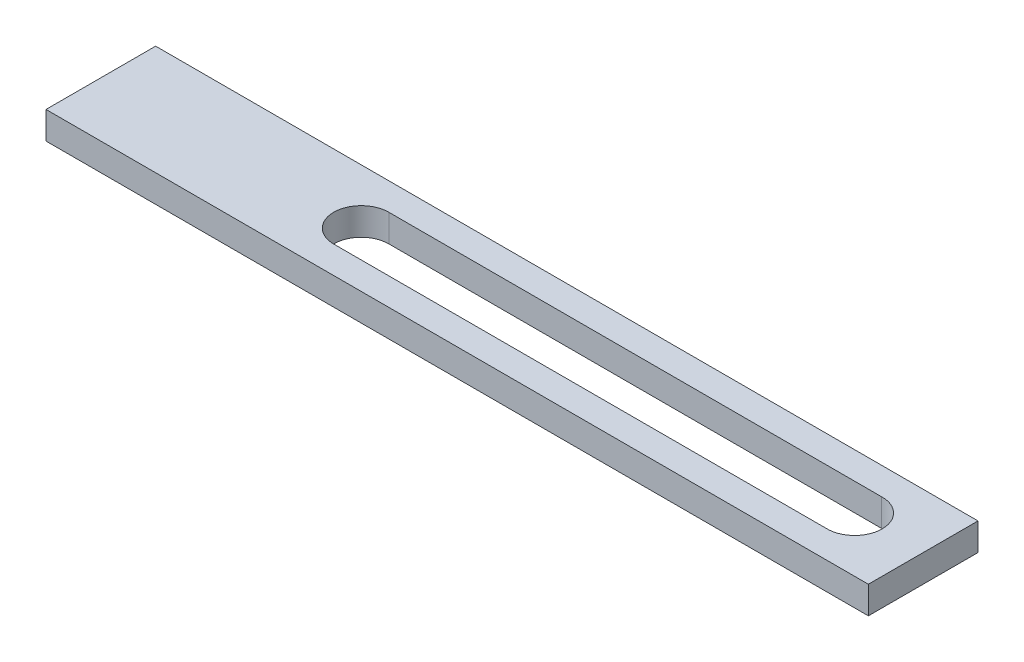
ISO-10303-21;
HEADER;
FILE_DESCRIPTION(('STEP AP214'),'2;1');
FILE_NAME('part.step','',(''),(''),'','','');
FILE_SCHEMA(('AUTOMOTIVE_DESIGN { 1 0 10303 214 1 1 1 1 }'));
ENDSEC;
DATA;
#1=APPLICATION_CONTEXT('core data for automotive mechanical design processes');
#2=APPLICATION_PROTOCOL_DEFINITION('international standard','automotive_design',2000,#1);
#3=PRODUCT_CONTEXT('',#1,'mechanical');
#4=PRODUCT('Part','Part','',(#3));
#5=PRODUCT_RELATED_PRODUCT_CATEGORY('part','',(#4));
#6=PRODUCT_DEFINITION_FORMATION('','',#4);
#7=PRODUCT_DEFINITION_CONTEXT('part definition',#1,'design');
#8=PRODUCT_DEFINITION('design','',#6,#7);
#9=PRODUCT_DEFINITION_SHAPE('','',#8);
#10=(LENGTH_UNIT() NAMED_UNIT(*) SI_UNIT(.MILLI.,.METRE.));
#11=(NAMED_UNIT(*) PLANE_ANGLE_UNIT() SI_UNIT($,.RADIAN.));
#12=(NAMED_UNIT(*) SI_UNIT($,.STERADIAN.) SOLID_ANGLE_UNIT());
#13=UNCERTAINTY_MEASURE_WITH_UNIT(LENGTH_MEASURE(1.E-05),#10,'distance_accuracy_value','');
#14=(GEOMETRIC_REPRESENTATION_CONTEXT(3) GLOBAL_UNCERTAINTY_ASSIGNED_CONTEXT((#13)) GLOBAL_UNIT_ASSIGNED_CONTEXT((#10,
#11,#12)) REPRESENTATION_CONTEXT('',''));
#15=CARTESIAN_POINT('',(0.,0.,0.));
#16=DIRECTION('',(0.,0.,1.));
#17=DIRECTION('',(1.,0.,0.));
#18=AXIS2_PLACEMENT_3D('',#15,#16,#17);
#19=CARTESIAN_POINT('',(0.,10.,0.));
#20=DIRECTION('',(1.,0.,0.));
#21=DIRECTION('',(0.,0.,-1.));
#22=AXIS2_PLACEMENT_3D('',#19,#20,#21);
#23=PLANE('',#22);
#24=DIRECTION('',(0.,0.,1.));
#25=VECTOR('',#24,1.);
#26=CARTESIAN_POINT('',(0.,0.,0.));
#27=LINE('',#26,#25);
#28=CARTESIAN_POINT('',(0.,0.,-40.));
#29=VERTEX_POINT('',#28);
#30=CARTESIAN_POINT('',(0.,0.,0.));
#31=VERTEX_POINT('',#30);
#32=EDGE_CURVE('E104',#29,#31,#27,.T.);
#33=ORIENTED_EDGE('',*,*,#32,.T.);
#34=DIRECTION('',(0.,-1.,0.));
#35=VECTOR('',#34,1.);
#36=CARTESIAN_POINT('',(0.,10.,0.));
#37=LINE('',#36,#35);
#38=CARTESIAN_POINT('',(0.,10.,0.));
#39=VERTEX_POINT('',#38);
#40=EDGE_CURVE('E11',#39,#31,#37,.T.);
#41=ORIENTED_EDGE('',*,*,#40,.F.);
#42=DIRECTION('',(0.,0.,1.));
#43=VECTOR('',#42,1.);
#44=CARTESIAN_POINT('',(0.,10.,0.));
#45=LINE('',#44,#43);
#46=CARTESIAN_POINT('',(0.,10.,-40.));
#47=VERTEX_POINT('',#46);
#48=EDGE_CURVE('E133',#47,#39,#45,.T.);
#49=ORIENTED_EDGE('',*,*,#48,.F.);
#50=DIRECTION('',(0.,-1.,0.));
#51=VECTOR('',#50,1.);
#52=CARTESIAN_POINT('',(0.,10.,-40.));
#53=LINE('',#52,#51);
#54=EDGE_CURVE('E143',#47,#29,#53,.T.);
#55=ORIENTED_EDGE('',*,*,#54,.T.);
#56=EDGE_LOOP('',(#33,#41,#49,#55));
#57=FACE_BOUND('',#56,.T.);
#58=ADVANCED_FACE('F34',(#57),#23,.F.);
#59=CARTESIAN_POINT('',(0.,10.,0.));
#60=DIRECTION('',(0.,0.,-1.));
#61=DIRECTION('',(-1.,0.,0.));
#62=AXIS2_PLACEMENT_3D('',#59,#60,#61);
#63=PLANE('',#62);
#64=DIRECTION('',(1.,0.,0.));
#65=VECTOR('',#64,1.);
#66=CARTESIAN_POINT('',(0.,0.,0.));
#67=LINE('',#66,#65);
#68=CARTESIAN_POINT('',(300.,0.,0.));
#69=VERTEX_POINT('',#68);
#70=EDGE_CURVE('E146',#31,#69,#67,.T.);
#71=ORIENTED_EDGE('',*,*,#70,.T.);
#72=DIRECTION('',(0.,-1.,0.));
#73=VECTOR('',#72,1.);
#74=CARTESIAN_POINT('',(300.,10.,0.));
#75=LINE('',#74,#73);
#76=CARTESIAN_POINT('',(300.,10.,0.));
#77=VERTEX_POINT('',#76);
#78=EDGE_CURVE('E41',#77,#69,#75,.T.);
#79=ORIENTED_EDGE('',*,*,#78,.F.);
#80=DIRECTION('',(1.,0.,0.));
#81=VECTOR('',#80,1.);
#82=CARTESIAN_POINT('',(0.,10.,0.));
#83=LINE('',#82,#81);
#84=EDGE_CURVE('E136',#39,#77,#83,.T.);
#85=ORIENTED_EDGE('',*,*,#84,.F.);
#86=ORIENTED_EDGE('',*,*,#40,.T.);
#87=EDGE_LOOP('',(#71,#79,#85,#86));
#88=FACE_BOUND('',#87,.T.);
#89=ADVANCED_FACE('F174',(#88),#63,.F.);
#90=CARTESIAN_POINT('',(300.,10.,0.));
#91=DIRECTION('',(-1.,0.,0.));
#92=DIRECTION('',(0.,0.,1.));
#93=AXIS2_PLACEMENT_3D('',#90,#91,#92);
#94=PLANE('',#93);
#95=DIRECTION('',(0.,0.,-1.));
#96=VECTOR('',#95,1.);
#97=CARTESIAN_POINT('',(300.,0.,0.));
#98=LINE('',#97,#96);
#99=CARTESIAN_POINT('',(300.,0.,-40.));
#100=VERTEX_POINT('',#99);
#101=EDGE_CURVE('E148',#69,#100,#98,.T.);
#102=ORIENTED_EDGE('',*,*,#101,.T.);
#103=DIRECTION('',(0.,-1.,0.));
#104=VECTOR('',#103,1.);
#105=CARTESIAN_POINT('',(300.,10.,-40.));
#106=LINE('',#105,#104);
#107=CARTESIAN_POINT('',(300.,10.,-40.));
#108=VERTEX_POINT('',#107);
#109=EDGE_CURVE('E153',#108,#100,#106,.T.);
#110=ORIENTED_EDGE('',*,*,#109,.F.);
#111=DIRECTION('',(0.,0.,-1.));
#112=VECTOR('',#111,1.);
#113=CARTESIAN_POINT('',(300.,10.,0.));
#114=LINE('',#113,#112);
#115=EDGE_CURVE('E139',#77,#108,#114,.T.);
#116=ORIENTED_EDGE('',*,*,#115,.F.);
#117=ORIENTED_EDGE('',*,*,#78,.T.);
#118=EDGE_LOOP('',(#102,#110,#116,#117));
#119=FACE_BOUND('',#118,.T.);
#120=ADVANCED_FACE('F160',(#119),#94,.F.);
#121=CARTESIAN_POINT('',(0.,10.,-40.));
#122=DIRECTION('',(0.,0.,1.));
#123=DIRECTION('',(1.,0.,0.));
#124=AXIS2_PLACEMENT_3D('',#121,#122,#123);
#125=PLANE('',#124);
#126=DIRECTION('',(-1.,0.,0.));
#127=VECTOR('',#126,1.);
#128=CARTESIAN_POINT('',(0.,0.,-40.));
#129=LINE('',#128,#127);
#130=EDGE_CURVE('E137',#100,#29,#129,.T.);
#131=ORIENTED_EDGE('',*,*,#130,.T.);
#132=ORIENTED_EDGE('',*,*,#54,.F.);
#133=DIRECTION('',(-1.,0.,0.));
#134=VECTOR('',#133,1.);
#135=CARTESIAN_POINT('',(0.,10.,-40.));
#136=LINE('',#135,#134);
#137=EDGE_CURVE('E141',#108,#47,#136,.T.);
#138=ORIENTED_EDGE('',*,*,#137,.F.);
#139=ORIENTED_EDGE('',*,*,#109,.T.);
#140=EDGE_LOOP('',(#131,#132,#138,#139));
#141=FACE_BOUND('',#140,.T.);
#142=ADVANCED_FACE('F167',(#141),#125,.F.);
#143=CARTESIAN_POINT('',(0.,10.,0.));
#144=DIRECTION('',(0.,-1.,0.));
#145=DIRECTION('',(0.,0.,-1.));
#146=AXIS2_PLACEMENT_3D('',#143,#144,#145);
#147=PLANE('',#146);
#148=DIRECTION('',(0.999999999769228,0.,-2.14835530012915E-05));
#149=VECTOR('',#148,1.);
#150=CARTESIAN_POINT('',(95.,10.,-9.95));
#151=LINE('',#150,#149);
#152=CARTESIAN_POINT('',(95.,10.,-9.95));
#153=VERTEX_POINT('',#152);
#154=CARTESIAN_POINT('',(274.721446051857,10.,-9.95386105521261));
#155=VERTEX_POINT('',#154);
#156=EDGE_CURVE('E117',#153,#155,#151,.T.);
#157=ORIENTED_EDGE('',*,*,#156,.F.);
#158=CARTESIAN_POINT('',(95.,10.,-20.));
#159=DIRECTION('',(0.,1.,0.));
#160=DIRECTION('',(0.,0.,1.));
#161=AXIS2_PLACEMENT_3D('',#158,#159,#160);
#162=CIRCLE('',#161,10.05);
#163=CARTESIAN_POINT('',(95.,10.,-30.05));
#164=VERTEX_POINT('',#163);
#165=EDGE_CURVE('E48',#164,#153,#162,.T.);
#166=ORIENTED_EDGE('',*,*,#165,.F.);
#167=DIRECTION('',(-0.999999999769228,0.,-2.14835530012818E-05));
#168=VECTOR('',#167,1.);
#169=CARTESIAN_POINT('',(95.,10.,-30.05));
#170=LINE('',#169,#168);
#171=CARTESIAN_POINT('',(274.721446051857,10.,-30.0461389447874));
#172=VERTEX_POINT('',#171);
#173=EDGE_CURVE('E110',#172,#164,#170,.T.);
#174=ORIENTED_EDGE('',*,*,#173,.F.);
#175=CARTESIAN_POINT('',(275.,10.,-20.));
#176=DIRECTION('',(0.,1.,0.));
#177=DIRECTION('',(0.,0.,-1.));
#178=AXIS2_PLACEMENT_3D('',#175,#176,#177);
#179=CIRCLE('',#178,10.05);
#180=EDGE_CURVE('E124',#155,#172,#179,.T.);
#181=ORIENTED_EDGE('',*,*,#180,.F.);
#182=EDGE_LOOP('',(#157,#166,#174,#181));
#183=FACE_BOUND('',#182,.T.);
#184=ORIENTED_EDGE('',*,*,#48,.T.);
#185=ORIENTED_EDGE('',*,*,#84,.T.);
#186=ORIENTED_EDGE('',*,*,#115,.T.);
#187=ORIENTED_EDGE('',*,*,#137,.T.);
#188=EDGE_LOOP('',(#184,#185,#186,#187));
#189=FACE_BOUND('',#188,.T.);
#190=ADVANCED_FACE('F173',(#183,#189),#147,.F.);
#191=CARTESIAN_POINT('',(0.,0.,0.));
#192=DIRECTION('',(0.,-1.,0.));
#193=DIRECTION('',(0.,0.,-1.));
#194=AXIS2_PLACEMENT_3D('',#191,#192,#193);
#195=PLANE('',#194);
#196=CARTESIAN_POINT('',(95.,0.,-20.));
#197=DIRECTION('',(0.,-1.,0.));
#198=DIRECTION('',(0.,0.,-1.));
#199=AXIS2_PLACEMENT_3D('',#196,#197,#198);
#200=CIRCLE('',#199,10.05);
#201=CARTESIAN_POINT('',(95.,0.,-30.05));
#202=VERTEX_POINT('',#201);
#203=CARTESIAN_POINT('',(95.,0.,-9.95));
#204=VERTEX_POINT('',#203);
#205=EDGE_CURVE('E108',#202,#204,#200,.F.);
#206=ORIENTED_EDGE('',*,*,#205,.T.);
#207=DIRECTION('',(0.999999999769229,0.,-2.14835530012915E-05));
#208=VECTOR('',#207,1.);
#209=CARTESIAN_POINT('',(95.,0.,-9.95));
#210=LINE('',#209,#208);
#211=CARTESIAN_POINT('',(274.721446051857,0.,-9.95386105521261));
#212=VERTEX_POINT('',#211);
#213=EDGE_CURVE('E97',#204,#212,#210,.T.);
#214=ORIENTED_EDGE('',*,*,#213,.T.);
#215=CARTESIAN_POINT('',(275.,0.,-20.));
#216=DIRECTION('',(0.,-1.,0.));
#217=DIRECTION('',(0.,0.,-1.));
#218=AXIS2_PLACEMENT_3D('',#215,#216,#217);
#219=CIRCLE('',#218,10.05);
#220=CARTESIAN_POINT('',(274.721446051857,0.,-30.0461389447874));
#221=VERTEX_POINT('',#220);
#222=EDGE_CURVE('E119',#212,#221,#219,.F.);
#223=ORIENTED_EDGE('',*,*,#222,.T.);
#224=DIRECTION('',(-0.999999999769229,0.,-2.14835530012818E-05));
#225=VECTOR('',#224,1.);
#226=CARTESIAN_POINT('',(95.,0.,-30.05));
#227=LINE('',#226,#225);
#228=EDGE_CURVE('E115',#221,#202,#227,.T.);
#229=ORIENTED_EDGE('',*,*,#228,.T.);
#230=EDGE_LOOP('',(#206,#214,#223,#229));
#231=FACE_BOUND('',#230,.T.);
#232=ORIENTED_EDGE('',*,*,#32,.F.);
#233=ORIENTED_EDGE('',*,*,#130,.F.);
#234=ORIENTED_EDGE('',*,*,#101,.F.);
#235=ORIENTED_EDGE('',*,*,#70,.F.);
#236=EDGE_LOOP('',(#232,#233,#234,#235));
#237=FACE_BOUND('',#236,.T.);
#238=ADVANCED_FACE('F113',(#231,#237),#195,.T.);
#239=CARTESIAN_POINT('',(95.,-0.000999999999999265,-20.));
#240=DIRECTION('',(0.,1.,0.));
#241=DIRECTION('',(0.,0.,1.));
#242=AXIS2_PLACEMENT_3D('',#239,#240,#241);
#243=CYLINDRICAL_SURFACE('',#242,10.05);
#244=DIRECTION('',(0.,1.,0.));
#245=VECTOR('',#244,1.);
#246=CARTESIAN_POINT('',(95.,-0.000999999999999265,-30.05));
#247=LINE('',#246,#245);
#248=EDGE_CURVE('E105',#202,#164,#247,.T.);
#249=ORIENTED_EDGE('',*,*,#248,.T.);
#250=ORIENTED_EDGE('',*,*,#165,.T.);
#251=DIRECTION('',(0.,1.,0.));
#252=VECTOR('',#251,1.);
#253=CARTESIAN_POINT('',(95.,-0.000999999999999265,-9.95));
#254=LINE('',#253,#252);
#255=EDGE_CURVE('E99',#204,#153,#254,.T.);
#256=ORIENTED_EDGE('',*,*,#255,.F.);
#257=ORIENTED_EDGE('',*,*,#205,.F.);
#258=EDGE_LOOP('',(#249,#250,#256,#257));
#259=FACE_BOUND('',#258,.T.);
#260=ADVANCED_FACE('F107',(#259),#243,.F.);
#261=CARTESIAN_POINT('',(95.,-0.000999999999999265,-30.05));
#262=DIRECTION('',(2.14835530012818E-05,0.,-0.999999999769229));
#263=DIRECTION('',(-0.999999999769229,0.,-2.14835530012818E-05));
#264=AXIS2_PLACEMENT_3D('',#261,#262,#263);
#265=PLANE('',#264);
#266=DIRECTION('',(0.,1.,0.));
#267=VECTOR('',#266,1.);
#268=CARTESIAN_POINT('',(274.721446051857,-0.000999999999999265,-30.0461389447874));
#269=LINE('',#268,#267);
#270=EDGE_CURVE('E130',#221,#172,#269,.T.);
#271=ORIENTED_EDGE('',*,*,#270,.T.);
#272=ORIENTED_EDGE('',*,*,#173,.T.);
#273=ORIENTED_EDGE('',*,*,#248,.F.);
#274=ORIENTED_EDGE('',*,*,#228,.F.);
#275=EDGE_LOOP('',(#271,#272,#273,#274));
#276=FACE_BOUND('',#275,.T.);
#277=ADVANCED_FACE('F191',(#276),#265,.F.);
#278=CARTESIAN_POINT('',(275.,-0.000999999999999265,-20.));
#279=DIRECTION('',(0.,1.,0.));
#280=DIRECTION('',(0.,0.,1.));
#281=AXIS2_PLACEMENT_3D('',#278,#279,#280);
#282=CYLINDRICAL_SURFACE('',#281,10.05);
#283=DIRECTION('',(0.,1.,0.));
#284=VECTOR('',#283,1.);
#285=CARTESIAN_POINT('',(274.721446051857,-0.000999999999999265,-9.95386105521261));
#286=LINE('',#285,#284);
#287=EDGE_CURVE('E56',#212,#155,#286,.T.);
#288=ORIENTED_EDGE('',*,*,#287,.T.);
#289=ORIENTED_EDGE('',*,*,#180,.T.);
#290=ORIENTED_EDGE('',*,*,#270,.F.);
#291=ORIENTED_EDGE('',*,*,#222,.F.);
#292=EDGE_LOOP('',(#288,#289,#290,#291));
#293=FACE_BOUND('',#292,.T.);
#294=ADVANCED_FACE('F194',(#293),#282,.F.);
#295=CARTESIAN_POINT('',(95.,-0.000999999999999265,-9.95));
#296=DIRECTION('',(2.14835530012915E-05,0.,0.999999999769229));
#297=DIRECTION('',(0.999999999769229,0.,-2.14835530012915E-05));
#298=AXIS2_PLACEMENT_3D('',#295,#296,#297);
#299=PLANE('',#298);
#300=ORIENTED_EDGE('',*,*,#255,.T.);
#301=ORIENTED_EDGE('',*,*,#156,.T.);
#302=ORIENTED_EDGE('',*,*,#287,.F.);
#303=ORIENTED_EDGE('',*,*,#213,.F.);
#304=EDGE_LOOP('',(#300,#301,#302,#303));
#305=FACE_BOUND('',#304,.T.);
#306=ADVANCED_FACE('F98',(#305),#299,.F.);
#307=CLOSED_SHELL('',(#58,#89,#120,#142,#190,#238,#260,#277,#294,#306));
#308=MANIFOLD_SOLID_BREP('B2',#307);
#309=ADVANCED_BREP_SHAPE_REPRESENTATION('',(#18,#308),#14);
#310=SHAPE_DEFINITION_REPRESENTATION(#9,#309);
ENDSEC;
END-ISO-10303-21;
